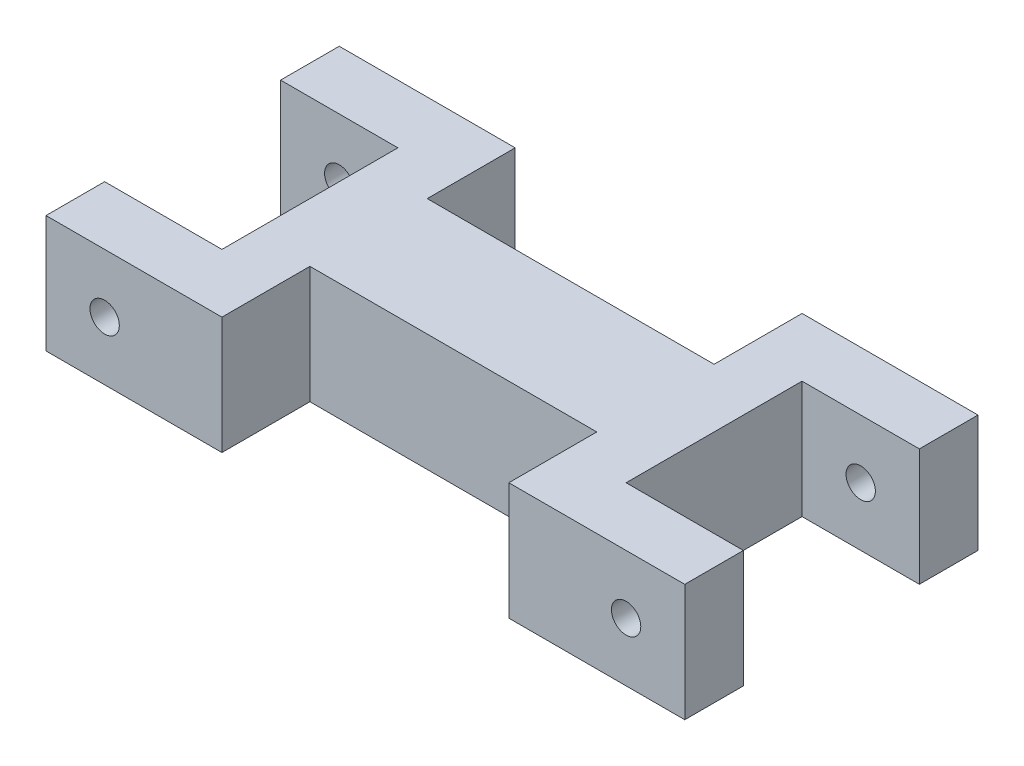
ISO-10303-21;
HEADER;
FILE_DESCRIPTION(('STEP AP214'),'2;1');
FILE_NAME('part.step','',(''),(''),'','','');
FILE_SCHEMA(('AUTOMOTIVE_DESIGN { 1 0 10303 214 1 1 1 1 }'));
ENDSEC;
DATA;
#1=APPLICATION_CONTEXT('core data for automotive mechanical design processes');
#2=APPLICATION_PROTOCOL_DEFINITION('international standard','automotive_design',2000,#1);
#3=PRODUCT_CONTEXT('',#1,'mechanical');
#4=PRODUCT('Part','Part','',(#3));
#5=PRODUCT_RELATED_PRODUCT_CATEGORY('part','',(#4));
#6=PRODUCT_DEFINITION_FORMATION('','',#4);
#7=PRODUCT_DEFINITION_CONTEXT('part definition',#1,'design');
#8=PRODUCT_DEFINITION('design','',#6,#7);
#9=PRODUCT_DEFINITION_SHAPE('','',#8);
#10=(LENGTH_UNIT() NAMED_UNIT(*) SI_UNIT(.MILLI.,.METRE.));
#11=(NAMED_UNIT(*) PLANE_ANGLE_UNIT() SI_UNIT($,.RADIAN.));
#12=(NAMED_UNIT(*) SI_UNIT($,.STERADIAN.) SOLID_ANGLE_UNIT());
#13=UNCERTAINTY_MEASURE_WITH_UNIT(LENGTH_MEASURE(1.E-05),#10,'distance_accuracy_value','');
#14=(GEOMETRIC_REPRESENTATION_CONTEXT(3) GLOBAL_UNCERTAINTY_ASSIGNED_CONTEXT((#13)) GLOBAL_UNIT_ASSIGNED_CONTEXT((#10,
#11,#12)) REPRESENTATION_CONTEXT('',''));
#15=CARTESIAN_POINT('',(0.,0.,0.));
#16=DIRECTION('',(0.,0.,1.));
#17=DIRECTION('',(1.,0.,0.));
#18=AXIS2_PLACEMENT_3D('',#15,#16,#17);
#19=CARTESIAN_POINT('',(0.,12.7,-9.525));
#20=DIRECTION('',(1.,0.,0.));
#21=DIRECTION('',(0.,0.,-1.));
#22=AXIS2_PLACEMENT_3D('',#19,#20,#21);
#23=PLANE('',#22);
#24=DIRECTION('',(0.,0.,1.));
#25=VECTOR('',#24,1.);
#26=CARTESIAN_POINT('',(0.,0.,-9.525));
#27=LINE('',#26,#25);
#28=CARTESIAN_POINT('',(0.,0.,-9.525));
#29=VERTEX_POINT('',#28);
#30=CARTESIAN_POINT('',(0.,0.,9.525));
#31=VERTEX_POINT('',#30);
#32=EDGE_CURVE('E202',#29,#31,#27,.T.);
#33=ORIENTED_EDGE('',*,*,#32,.T.);
#34=DIRECTION('',(0.,-1.,0.));
#35=VECTOR('',#34,1.);
#36=CARTESIAN_POINT('',(0.,12.7,9.525));
#37=LINE('',#36,#35);
#38=CARTESIAN_POINT('',(0.,12.7,9.525));
#39=VERTEX_POINT('',#38);
#40=EDGE_CURVE('E11',#39,#31,#37,.T.);
#41=ORIENTED_EDGE('',*,*,#40,.F.);
#42=DIRECTION('',(0.,0.,1.));
#43=VECTOR('',#42,1.);
#44=CARTESIAN_POINT('',(0.,12.7,-9.525));
#45=LINE('',#44,#43);
#46=CARTESIAN_POINT('',(0.,12.7,-9.525));
#47=VERTEX_POINT('',#46);
#48=EDGE_CURVE('E241',#47,#39,#45,.T.);
#49=ORIENTED_EDGE('',*,*,#48,.F.);
#50=DIRECTION('',(0.,-1.,0.));
#51=VECTOR('',#50,1.);
#52=CARTESIAN_POINT('',(0.,12.7,-9.525));
#53=LINE('',#52,#51);
#54=EDGE_CURVE('E198',#47,#29,#53,.T.);
#55=ORIENTED_EDGE('',*,*,#54,.T.);
#56=EDGE_LOOP('',(#33,#41,#49,#55));
#57=FACE_BOUND('',#56,.T.);
#58=ADVANCED_FACE('F33',(#57),#23,.F.);
#59=CARTESIAN_POINT('',(0.,12.7,9.525));
#60=DIRECTION('',(0.,0.,1.));
#61=DIRECTION('',(1.,0.,0.));
#62=AXIS2_PLACEMENT_3D('',#59,#60,#61);
#63=PLANE('',#62);
#64=CARTESIAN_POINT('',(-6.35,6.34999999999879,9.525));
#65=DIRECTION('',(0.,0.,1.));
#66=DIRECTION('',(1.,0.,0.));
#67=AXIS2_PLACEMENT_3D('',#64,#65,#66);
#68=CIRCLE('',#67,1.5875);
#69=CARTESIAN_POINT('',(-4.7625,6.34999999999879,9.525));
#70=VERTEX_POINT('',#69);
#71=EDGE_CURVE('E440',#70,#70,#68,.T.);
#72=ORIENTED_EDGE('',*,*,#71,.T.);
#73=EDGE_LOOP('',(#72));
#74=FACE_BOUND('',#73,.T.);
#75=DIRECTION('',(-1.,0.,0.));
#76=VECTOR('',#75,1.);
#77=CARTESIAN_POINT('',(0.,0.,9.525));
#78=LINE('',#77,#76);
#79=CARTESIAN_POINT('',(-12.7,0.,9.525));
#80=VERTEX_POINT('',#79);
#81=EDGE_CURVE('E205',#31,#80,#78,.T.);
#82=ORIENTED_EDGE('',*,*,#81,.T.);
#83=DIRECTION('',(0.,-1.,0.));
#84=VECTOR('',#83,1.);
#85=CARTESIAN_POINT('',(-12.7,12.7,9.525));
#86=LINE('',#85,#84);
#87=CARTESIAN_POINT('',(-12.7,12.7,9.525));
#88=VERTEX_POINT('',#87);
#89=EDGE_CURVE('E42',#88,#80,#86,.T.);
#90=ORIENTED_EDGE('',*,*,#89,.F.);
#91=DIRECTION('',(-1.,0.,0.));
#92=VECTOR('',#91,1.);
#93=CARTESIAN_POINT('',(0.,12.7,9.525));
#94=LINE('',#93,#92);
#95=EDGE_CURVE('E129',#39,#88,#94,.T.);
#96=ORIENTED_EDGE('',*,*,#95,.F.);
#97=ORIENTED_EDGE('',*,*,#40,.T.);
#98=EDGE_LOOP('',(#82,#90,#96,#97));
#99=FACE_BOUND('',#98,.T.);
#100=ADVANCED_FACE('F362',(#74,#99),#63,.F.);
#101=CARTESIAN_POINT('',(-12.7,12.7,9.525));
#102=DIRECTION('',(1.,0.,0.));
#103=DIRECTION('',(0.,0.,-1.));
#104=AXIS2_PLACEMENT_3D('',#101,#102,#103);
#105=PLANE('',#104);
#106=DIRECTION('',(0.,0.,1.));
#107=VECTOR('',#106,1.);
#108=CARTESIAN_POINT('',(-12.7,0.,9.525));
#109=LINE('',#108,#107);
#110=CARTESIAN_POINT('',(-12.7,0.,15.875));
#111=VERTEX_POINT('',#110);
#112=EDGE_CURVE('E208',#80,#111,#109,.T.);
#113=ORIENTED_EDGE('',*,*,#112,.T.);
#114=DIRECTION('',(0.,-1.,0.));
#115=VECTOR('',#114,1.);
#116=CARTESIAN_POINT('',(-12.7,12.7,15.875));
#117=LINE('',#116,#115);
#118=CARTESIAN_POINT('',(-12.7,12.7,15.875));
#119=VERTEX_POINT('',#118);
#120=EDGE_CURVE('E284',#119,#111,#117,.T.);
#121=ORIENTED_EDGE('',*,*,#120,.F.);
#122=DIRECTION('',(0.,0.,1.));
#123=VECTOR('',#122,1.);
#124=CARTESIAN_POINT('',(-12.7,12.7,9.525));
#125=LINE('',#124,#123);
#126=EDGE_CURVE('E293',#88,#119,#125,.T.);
#127=ORIENTED_EDGE('',*,*,#126,.F.);
#128=ORIENTED_EDGE('',*,*,#89,.T.);
#129=EDGE_LOOP('',(#113,#121,#127,#128));
#130=FACE_BOUND('',#129,.T.);
#131=ADVANCED_FACE('F291',(#130),#105,.F.);
#132=CARTESIAN_POINT('',(-12.7,12.7,15.875));
#133=DIRECTION('',(0.,0.,-1.));
#134=DIRECTION('',(-1.,0.,0.));
#135=AXIS2_PLACEMENT_3D('',#132,#133,#134);
#136=PLANE('',#135);
#137=CARTESIAN_POINT('',(-6.35,6.34999999999879,15.875));
#138=DIRECTION('',(0.,0.,1.));
#139=DIRECTION('',(1.,0.,0.));
#140=AXIS2_PLACEMENT_3D('',#137,#138,#139);
#141=CIRCLE('',#140,1.5875);
#142=CARTESIAN_POINT('',(-4.7625,6.34999999999879,15.875));
#143=VERTEX_POINT('',#142);
#144=EDGE_CURVE('E431',#143,#143,#141,.T.);
#145=ORIENTED_EDGE('',*,*,#144,.F.);
#146=EDGE_LOOP('',(#145));
#147=FACE_BOUND('',#146,.T.);
#148=DIRECTION('',(1.,0.,0.));
#149=VECTOR('',#148,1.);
#150=CARTESIAN_POINT('',(-12.7,0.,15.875));
#151=LINE('',#150,#149);
#152=CARTESIAN_POINT('',(6.35,0.,15.875));
#153=VERTEX_POINT('',#152);
#154=EDGE_CURVE('E210',#111,#153,#151,.T.);
#155=ORIENTED_EDGE('',*,*,#154,.T.);
#156=DIRECTION('',(0.,-1.,0.));
#157=VECTOR('',#156,1.);
#158=CARTESIAN_POINT('',(6.35,12.7,15.875));
#159=LINE('',#158,#157);
#160=CARTESIAN_POINT('',(6.35,12.7,15.875));
#161=VERTEX_POINT('',#160);
#162=EDGE_CURVE('E281',#161,#153,#159,.T.);
#163=ORIENTED_EDGE('',*,*,#162,.F.);
#164=DIRECTION('',(1.,0.,0.));
#165=VECTOR('',#164,1.);
#166=CARTESIAN_POINT('',(-12.7,12.7,15.875));
#167=LINE('',#166,#165);
#168=EDGE_CURVE('E311',#119,#161,#167,.T.);
#169=ORIENTED_EDGE('',*,*,#168,.F.);
#170=ORIENTED_EDGE('',*,*,#120,.T.);
#171=EDGE_LOOP('',(#155,#163,#169,#170));
#172=FACE_BOUND('',#171,.T.);
#173=ADVANCED_FACE('F302',(#147,#172),#136,.F.);
#174=CARTESIAN_POINT('',(6.35,12.7,15.875));
#175=DIRECTION('',(-1.,0.,0.));
#176=DIRECTION('',(0.,0.,1.));
#177=AXIS2_PLACEMENT_3D('',#174,#175,#176);
#178=PLANE('',#177);
#179=DIRECTION('',(0.,0.,-1.));
#180=VECTOR('',#179,1.);
#181=CARTESIAN_POINT('',(6.35,0.,15.875));
#182=LINE('',#181,#180);
#183=CARTESIAN_POINT('',(6.34999999999999,0.,6.35));
#184=VERTEX_POINT('',#183);
#185=EDGE_CURVE('E212',#153,#184,#182,.T.);
#186=ORIENTED_EDGE('',*,*,#185,.T.);
#187=DIRECTION('',(0.,-1.,0.));
#188=VECTOR('',#187,1.);
#189=CARTESIAN_POINT('',(6.34999999999999,12.7,6.35));
#190=LINE('',#189,#188);
#191=CARTESIAN_POINT('',(6.34999999999999,12.7,6.35));
#192=VERTEX_POINT('',#191);
#193=EDGE_CURVE('E278',#192,#184,#190,.T.);
#194=ORIENTED_EDGE('',*,*,#193,.F.);
#195=DIRECTION('',(0.,0.,-1.));
#196=VECTOR('',#195,1.);
#197=CARTESIAN_POINT('',(6.35,12.7,15.875));
#198=LINE('',#197,#196);
#199=EDGE_CURVE('E308',#161,#192,#198,.T.);
#200=ORIENTED_EDGE('',*,*,#199,.F.);
#201=ORIENTED_EDGE('',*,*,#162,.T.);
#202=EDGE_LOOP('',(#186,#194,#200,#201));
#203=FACE_BOUND('',#202,.T.);
#204=ADVANCED_FACE('F306',(#203),#178,.F.);
#205=CARTESIAN_POINT('',(6.34999999999999,12.7,6.35));
#206=DIRECTION('',(0.,0.,-1.));
#207=DIRECTION('',(-1.,0.,0.));
#208=AXIS2_PLACEMENT_3D('',#205,#206,#207);
#209=PLANE('',#208);
#210=DIRECTION('',(1.,0.,0.));
#211=VECTOR('',#210,1.);
#212=CARTESIAN_POINT('',(6.34999999999999,0.,6.35));
#213=LINE('',#212,#211);
#214=CARTESIAN_POINT('',(37.410945752,0.,6.35));
#215=VERTEX_POINT('',#214);
#216=EDGE_CURVE('E214',#184,#215,#213,.T.);
#217=ORIENTED_EDGE('',*,*,#216,.T.);
#218=DIRECTION('',(0.,-1.,0.));
#219=VECTOR('',#218,1.);
#220=CARTESIAN_POINT('',(37.410945752,12.7,6.35));
#221=LINE('',#220,#219);
#222=CARTESIAN_POINT('',(37.410945752,12.7,6.35));
#223=VERTEX_POINT('',#222);
#224=EDGE_CURVE('E275',#223,#215,#221,.T.);
#225=ORIENTED_EDGE('',*,*,#224,.F.);
#226=DIRECTION('',(1.,0.,0.));
#227=VECTOR('',#226,1.);
#228=CARTESIAN_POINT('',(6.34999999999999,12.7,6.35));
#229=LINE('',#228,#227);
#230=EDGE_CURVE('E310',#192,#223,#229,.T.);
#231=ORIENTED_EDGE('',*,*,#230,.F.);
#232=ORIENTED_EDGE('',*,*,#193,.T.);
#233=EDGE_LOOP('',(#217,#225,#231,#232));
#234=FACE_BOUND('',#233,.T.);
#235=ADVANCED_FACE('F378',(#234),#209,.F.);
#236=CARTESIAN_POINT('',(37.410945752,12.7,6.35));
#237=DIRECTION('',(1.,0.,0.));
#238=DIRECTION('',(0.,0.,-1.));
#239=AXIS2_PLACEMENT_3D('',#236,#237,#238);
#240=PLANE('',#239);
#241=DIRECTION('',(0.,0.,1.));
#242=VECTOR('',#241,1.);
#243=CARTESIAN_POINT('',(37.410945752,0.,6.35));
#244=LINE('',#243,#242);
#245=CARTESIAN_POINT('',(37.410945752,0.,15.875));
#246=VERTEX_POINT('',#245);
#247=EDGE_CURVE('E216',#215,#246,#244,.T.);
#248=ORIENTED_EDGE('',*,*,#247,.T.);
#249=DIRECTION('',(0.,-1.,0.));
#250=VECTOR('',#249,1.);
#251=CARTESIAN_POINT('',(37.410945752,12.7,15.875));
#252=LINE('',#251,#250);
#253=CARTESIAN_POINT('',(37.410945752,12.7,15.875));
#254=VERTEX_POINT('',#253);
#255=EDGE_CURVE('E272',#254,#246,#252,.T.);
#256=ORIENTED_EDGE('',*,*,#255,.F.);
#257=DIRECTION('',(0.,0.,1.));
#258=VECTOR('',#257,1.);
#259=CARTESIAN_POINT('',(37.410945752,12.7,6.35));
#260=LINE('',#259,#258);
#261=EDGE_CURVE('E313',#223,#254,#260,.T.);
#262=ORIENTED_EDGE('',*,*,#261,.F.);
#263=ORIENTED_EDGE('',*,*,#224,.T.);
#264=EDGE_LOOP('',(#248,#256,#262,#263));
#265=FACE_BOUND('',#264,.T.);
#266=ADVANCED_FACE('F381',(#265),#240,.F.);
#267=CARTESIAN_POINT('',(37.410945752,12.7,15.875));
#268=DIRECTION('',(0.,0.,-1.));
#269=DIRECTION('',(-1.,0.,0.));
#270=AXIS2_PLACEMENT_3D('',#267,#268,#269);
#271=PLANE('',#270);
#272=CARTESIAN_POINT('',(50.110945752,6.35,15.875));
#273=DIRECTION('',(0.,0.,1.));
#274=DIRECTION('',(1.,0.,0.));
#275=AXIS2_PLACEMENT_3D('',#272,#273,#274);
#276=CIRCLE('',#275,1.58749999999998);
#277=CARTESIAN_POINT('',(51.698445752,6.35,15.875));
#278=VERTEX_POINT('',#277);
#279=EDGE_CURVE('E430',#278,#278,#276,.T.);
#280=ORIENTED_EDGE('',*,*,#279,.F.);
#281=EDGE_LOOP('',(#280));
#282=FACE_BOUND('',#281,.T.);
#283=DIRECTION('',(1.,0.,0.));
#284=VECTOR('',#283,1.);
#285=CARTESIAN_POINT('',(37.410945752,0.,15.875));
#286=LINE('',#285,#284);
#287=CARTESIAN_POINT('',(56.460945752,0.,15.875));
#288=VERTEX_POINT('',#287);
#289=EDGE_CURVE('E218',#246,#288,#286,.T.);
#290=ORIENTED_EDGE('',*,*,#289,.T.);
#291=DIRECTION('',(0.,-1.,0.));
#292=VECTOR('',#291,1.);
#293=CARTESIAN_POINT('',(56.460945752,12.7,15.875));
#294=LINE('',#293,#292);
#295=CARTESIAN_POINT('',(56.460945752,12.7,15.875));
#296=VERTEX_POINT('',#295);
#297=EDGE_CURVE('E269',#296,#288,#294,.T.);
#298=ORIENTED_EDGE('',*,*,#297,.F.);
#299=DIRECTION('',(1.,0.,0.));
#300=VECTOR('',#299,1.);
#301=CARTESIAN_POINT('',(37.410945752,12.7,15.875));
#302=LINE('',#301,#300);
#303=EDGE_CURVE('E319',#254,#296,#302,.T.);
#304=ORIENTED_EDGE('',*,*,#303,.F.);
#305=ORIENTED_EDGE('',*,*,#255,.T.);
#306=EDGE_LOOP('',(#290,#298,#304,#305));
#307=FACE_BOUND('',#306,.T.);
#308=ADVANCED_FACE('F385',(#282,#307),#271,.F.);
#309=CARTESIAN_POINT('',(56.460945752,12.7,15.875));
#310=DIRECTION('',(-1.,0.,0.));
#311=DIRECTION('',(0.,0.,1.));
#312=AXIS2_PLACEMENT_3D('',#309,#310,#311);
#313=PLANE('',#312);
#314=DIRECTION('',(0.,0.,-1.));
#315=VECTOR('',#314,1.);
#316=CARTESIAN_POINT('',(56.460945752,0.,15.875));
#317=LINE('',#316,#315);
#318=CARTESIAN_POINT('',(56.460945752,0.,9.525));
#319=VERTEX_POINT('',#318);
#320=EDGE_CURVE('E220',#288,#319,#317,.T.);
#321=ORIENTED_EDGE('',*,*,#320,.T.);
#322=DIRECTION('',(0.,-1.,0.));
#323=VECTOR('',#322,1.);
#324=CARTESIAN_POINT('',(56.460945752,12.7,9.525));
#325=LINE('',#324,#323);
#326=CARTESIAN_POINT('',(56.460945752,12.7,9.525));
#327=VERTEX_POINT('',#326);
#328=EDGE_CURVE('E266',#327,#319,#325,.T.);
#329=ORIENTED_EDGE('',*,*,#328,.F.);
#330=DIRECTION('',(0.,0.,-1.));
#331=VECTOR('',#330,1.);
#332=CARTESIAN_POINT('',(56.460945752,12.7,15.875));
#333=LINE('',#332,#331);
#334=EDGE_CURVE('E321',#296,#327,#333,.T.);
#335=ORIENTED_EDGE('',*,*,#334,.F.);
#336=ORIENTED_EDGE('',*,*,#297,.T.);
#337=EDGE_LOOP('',(#321,#329,#335,#336));
#338=FACE_BOUND('',#337,.T.);
#339=ADVANCED_FACE('F389',(#338),#313,.F.);
#340=CARTESIAN_POINT('',(56.460945752,12.7,9.525));
#341=DIRECTION('',(0.,0.,1.));
#342=DIRECTION('',(1.,0.,0.));
#343=AXIS2_PLACEMENT_3D('',#340,#341,#342);
#344=PLANE('',#343);
#345=CARTESIAN_POINT('',(50.110945752,6.35,9.525));
#346=DIRECTION('',(0.,0.,1.));
#347=DIRECTION('',(1.,0.,0.));
#348=AXIS2_PLACEMENT_3D('',#345,#346,#347);
#349=CIRCLE('',#348,1.58749999999998);
#350=CARTESIAN_POINT('',(51.698445752,6.35,9.525));
#351=VERTEX_POINT('',#350);
#352=EDGE_CURVE('E206',#351,#351,#349,.T.);
#353=ORIENTED_EDGE('',*,*,#352,.T.);
#354=EDGE_LOOP('',(#353));
#355=FACE_BOUND('',#354,.T.);
#356=DIRECTION('',(-1.,0.,0.));
#357=VECTOR('',#356,1.);
#358=CARTESIAN_POINT('',(56.460945752,0.,9.525));
#359=LINE('',#358,#357);
#360=CARTESIAN_POINT('',(43.760945752,0.,9.525));
#361=VERTEX_POINT('',#360);
#362=EDGE_CURVE('E222',#319,#361,#359,.T.);
#363=ORIENTED_EDGE('',*,*,#362,.T.);
#364=DIRECTION('',(0.,-1.,0.));
#365=VECTOR('',#364,1.);
#366=CARTESIAN_POINT('',(43.760945752,12.7,9.525));
#367=LINE('',#366,#365);
#368=CARTESIAN_POINT('',(43.760945752,12.7,9.525));
#369=VERTEX_POINT('',#368);
#370=EDGE_CURVE('E263',#369,#361,#367,.T.);
#371=ORIENTED_EDGE('',*,*,#370,.F.);
#372=DIRECTION('',(-1.,0.,0.));
#373=VECTOR('',#372,1.);
#374=CARTESIAN_POINT('',(56.460945752,12.7,9.525));
#375=LINE('',#374,#373);
#376=EDGE_CURVE('E323',#327,#369,#375,.T.);
#377=ORIENTED_EDGE('',*,*,#376,.F.);
#378=ORIENTED_EDGE('',*,*,#328,.T.);
#379=EDGE_LOOP('',(#363,#371,#377,#378));
#380=FACE_BOUND('',#379,.T.);
#381=ADVANCED_FACE('F393',(#355,#380),#344,.F.);
#382=CARTESIAN_POINT('',(43.760945752,12.7,-9.525));
#383=DIRECTION('',(-1.,0.,0.));
#384=DIRECTION('',(0.,0.,1.));
#385=AXIS2_PLACEMENT_3D('',#382,#383,#384);
#386=PLANE('',#385);
#387=DIRECTION('',(0.,0.,-1.));
#388=VECTOR('',#387,1.);
#389=CARTESIAN_POINT('',(43.760945752,0.,-9.525));
#390=LINE('',#389,#388);
#391=CARTESIAN_POINT('',(43.760945752,0.,-9.525));
#392=VERTEX_POINT('',#391);
#393=EDGE_CURVE('E224',#361,#392,#390,.T.);
#394=ORIENTED_EDGE('',*,*,#393,.T.);
#395=DIRECTION('',(0.,-1.,0.));
#396=VECTOR('',#395,1.);
#397=CARTESIAN_POINT('',(43.760945752,12.7,-9.525));
#398=LINE('',#397,#396);
#399=CARTESIAN_POINT('',(43.760945752,12.7,-9.525));
#400=VERTEX_POINT('',#399);
#401=EDGE_CURVE('E260',#400,#392,#398,.T.);
#402=ORIENTED_EDGE('',*,*,#401,.F.);
#403=DIRECTION('',(0.,0.,-1.));
#404=VECTOR('',#403,1.);
#405=CARTESIAN_POINT('',(43.760945752,12.7,-9.525));
#406=LINE('',#405,#404);
#407=EDGE_CURVE('E325',#369,#400,#406,.T.);
#408=ORIENTED_EDGE('',*,*,#407,.F.);
#409=ORIENTED_EDGE('',*,*,#370,.T.);
#410=EDGE_LOOP('',(#394,#402,#408,#409));
#411=FACE_BOUND('',#410,.T.);
#412=ADVANCED_FACE('F397',(#411),#386,.F.);
#413=CARTESIAN_POINT('',(56.460945752,12.7,-9.525));
#414=DIRECTION('',(0.,0.,-1.));
#415=DIRECTION('',(-1.,0.,0.));
#416=AXIS2_PLACEMENT_3D('',#413,#414,#415);
#417=PLANE('',#416);
#418=CARTESIAN_POINT('',(50.110945752,6.35,-9.525));
#419=DIRECTION('',(0.,0.,-1.));
#420=DIRECTION('',(-1.,0.,0.));
#421=AXIS2_PLACEMENT_3D('',#418,#419,#420);
#422=CIRCLE('',#421,1.58749999999998);
#423=CARTESIAN_POINT('',(48.523445752,6.35,-9.525));
#424=VERTEX_POINT('',#423);
#425=EDGE_CURVE('E442',#424,#424,#422,.T.);
#426=ORIENTED_EDGE('',*,*,#425,.T.);
#427=EDGE_LOOP('',(#426));
#428=FACE_BOUND('',#427,.T.);
#429=DIRECTION('',(1.,0.,0.));
#430=VECTOR('',#429,1.);
#431=CARTESIAN_POINT('',(56.460945752,0.,-9.525));
#432=LINE('',#431,#430);
#433=CARTESIAN_POINT('',(56.460945752,0.,-9.525));
#434=VERTEX_POINT('',#433);
#435=EDGE_CURVE('E226',#392,#434,#432,.T.);
#436=ORIENTED_EDGE('',*,*,#435,.T.);
#437=DIRECTION('',(0.,-1.,0.));
#438=VECTOR('',#437,1.);
#439=CARTESIAN_POINT('',(56.460945752,12.7,-9.525));
#440=LINE('',#439,#438);
#441=CARTESIAN_POINT('',(56.460945752,12.7,-9.525));
#442=VERTEX_POINT('',#441);
#443=EDGE_CURVE('E257',#442,#434,#440,.T.);
#444=ORIENTED_EDGE('',*,*,#443,.F.);
#445=DIRECTION('',(1.,0.,0.));
#446=VECTOR('',#445,1.);
#447=CARTESIAN_POINT('',(56.460945752,12.7,-9.525));
#448=LINE('',#447,#446);
#449=EDGE_CURVE('E327',#400,#442,#448,.T.);
#450=ORIENTED_EDGE('',*,*,#449,.F.);
#451=ORIENTED_EDGE('',*,*,#401,.T.);
#452=EDGE_LOOP('',(#436,#444,#450,#451));
#453=FACE_BOUND('',#452,.T.);
#454=ADVANCED_FACE('F401',(#428,#453),#417,.F.);
#455=CARTESIAN_POINT('',(56.460945752,12.7,-15.875));
#456=DIRECTION('',(-1.,0.,0.));
#457=DIRECTION('',(0.,0.,1.));
#458=AXIS2_PLACEMENT_3D('',#455,#456,#457);
#459=PLANE('',#458);
#460=DIRECTION('',(0.,0.,-1.));
#461=VECTOR('',#460,1.);
#462=CARTESIAN_POINT('',(56.460945752,0.,-15.875));
#463=LINE('',#462,#461);
#464=CARTESIAN_POINT('',(56.460945752,0.,-15.875));
#465=VERTEX_POINT('',#464);
#466=EDGE_CURVE('E228',#434,#465,#463,.T.);
#467=ORIENTED_EDGE('',*,*,#466,.T.);
#468=DIRECTION('',(0.,-1.,0.));
#469=VECTOR('',#468,1.);
#470=CARTESIAN_POINT('',(56.460945752,12.7,-15.875));
#471=LINE('',#470,#469);
#472=CARTESIAN_POINT('',(56.460945752,12.7,-15.875));
#473=VERTEX_POINT('',#472);
#474=EDGE_CURVE('E254',#473,#465,#471,.T.);
#475=ORIENTED_EDGE('',*,*,#474,.F.);
#476=DIRECTION('',(0.,0.,-1.));
#477=VECTOR('',#476,1.);
#478=CARTESIAN_POINT('',(56.460945752,12.7,-15.875));
#479=LINE('',#478,#477);
#480=EDGE_CURVE('E329',#442,#473,#479,.T.);
#481=ORIENTED_EDGE('',*,*,#480,.F.);
#482=ORIENTED_EDGE('',*,*,#443,.T.);
#483=EDGE_LOOP('',(#467,#475,#481,#482));
#484=FACE_BOUND('',#483,.T.);
#485=ADVANCED_FACE('F405',(#484),#459,.F.);
#486=CARTESIAN_POINT('',(37.410945752,12.7,-15.875));
#487=DIRECTION('',(0.,0.,1.));
#488=DIRECTION('',(1.,0.,0.));
#489=AXIS2_PLACEMENT_3D('',#486,#487,#488);
#490=PLANE('',#489);
#491=CARTESIAN_POINT('',(50.110945752,6.35,-15.875));
#492=DIRECTION('',(0.,0.,1.));
#493=DIRECTION('',(1.,0.,0.));
#494=AXIS2_PLACEMENT_3D('',#491,#492,#493);
#495=CIRCLE('',#494,1.58749999999998);
#496=CARTESIAN_POINT('',(51.698445752,6.35,-15.875));
#497=VERTEX_POINT('',#496);
#498=EDGE_CURVE('E434',#497,#497,#495,.T.);
#499=ORIENTED_EDGE('',*,*,#498,.T.);
#500=EDGE_LOOP('',(#499));
#501=FACE_BOUND('',#500,.T.);
#502=DIRECTION('',(-1.,0.,0.));
#503=VECTOR('',#502,1.);
#504=CARTESIAN_POINT('',(37.410945752,0.,-15.875));
#505=LINE('',#504,#503);
#506=CARTESIAN_POINT('',(37.410945752,0.,-15.875));
#507=VERTEX_POINT('',#506);
#508=EDGE_CURVE('E230',#465,#507,#505,.T.);
#509=ORIENTED_EDGE('',*,*,#508,.T.);
#510=DIRECTION('',(0.,-1.,0.));
#511=VECTOR('',#510,1.);
#512=CARTESIAN_POINT('',(37.410945752,12.7,-15.875));
#513=LINE('',#512,#511);
#514=CARTESIAN_POINT('',(37.410945752,12.7,-15.875));
#515=VERTEX_POINT('',#514);
#516=EDGE_CURVE('E251',#515,#507,#513,.T.);
#517=ORIENTED_EDGE('',*,*,#516,.F.);
#518=DIRECTION('',(-1.,0.,0.));
#519=VECTOR('',#518,1.);
#520=CARTESIAN_POINT('',(37.410945752,12.7,-15.875));
#521=LINE('',#520,#519);
#522=EDGE_CURVE('E331',#473,#515,#521,.T.);
#523=ORIENTED_EDGE('',*,*,#522,.F.);
#524=ORIENTED_EDGE('',*,*,#474,.T.);
#525=EDGE_LOOP('',(#509,#517,#523,#524));
#526=FACE_BOUND('',#525,.T.);
#527=ADVANCED_FACE('F409',(#501,#526),#490,.F.);
#528=CARTESIAN_POINT('',(37.410945752,12.7,-6.35));
#529=DIRECTION('',(1.,0.,0.));
#530=DIRECTION('',(0.,0.,-1.));
#531=AXIS2_PLACEMENT_3D('',#528,#529,#530);
#532=PLANE('',#531);
#533=DIRECTION('',(0.,0.,1.));
#534=VECTOR('',#533,1.);
#535=CARTESIAN_POINT('',(37.410945752,0.,-6.35));
#536=LINE('',#535,#534);
#537=CARTESIAN_POINT('',(37.410945752,0.,-6.35));
#538=VERTEX_POINT('',#537);
#539=EDGE_CURVE('E232',#507,#538,#536,.T.);
#540=ORIENTED_EDGE('',*,*,#539,.T.);
#541=DIRECTION('',(0.,-1.,0.));
#542=VECTOR('',#541,1.);
#543=CARTESIAN_POINT('',(37.410945752,12.7,-6.35));
#544=LINE('',#543,#542);
#545=CARTESIAN_POINT('',(37.410945752,12.7,-6.35));
#546=VERTEX_POINT('',#545);
#547=EDGE_CURVE('E248',#546,#538,#544,.T.);
#548=ORIENTED_EDGE('',*,*,#547,.F.);
#549=DIRECTION('',(0.,0.,1.));
#550=VECTOR('',#549,1.);
#551=CARTESIAN_POINT('',(37.410945752,12.7,-6.35));
#552=LINE('',#551,#550);
#553=EDGE_CURVE('E333',#515,#546,#552,.T.);
#554=ORIENTED_EDGE('',*,*,#553,.F.);
#555=ORIENTED_EDGE('',*,*,#516,.T.);
#556=EDGE_LOOP('',(#540,#548,#554,#555));
#557=FACE_BOUND('',#556,.T.);
#558=ADVANCED_FACE('F413',(#557),#532,.F.);
#559=CARTESIAN_POINT('',(6.34999999999999,12.7,-6.35));
#560=DIRECTION('',(0.,0.,1.));
#561=DIRECTION('',(1.,0.,0.));
#562=AXIS2_PLACEMENT_3D('',#559,#560,#561);
#563=PLANE('',#562);
#564=DIRECTION('',(-1.,0.,0.));
#565=VECTOR('',#564,1.);
#566=CARTESIAN_POINT('',(6.34999999999999,0.,-6.35));
#567=LINE('',#566,#565);
#568=CARTESIAN_POINT('',(6.34999999999999,0.,-6.35));
#569=VERTEX_POINT('',#568);
#570=EDGE_CURVE('E234',#538,#569,#567,.T.);
#571=ORIENTED_EDGE('',*,*,#570,.T.);
#572=DIRECTION('',(0.,-1.,0.));
#573=VECTOR('',#572,1.);
#574=CARTESIAN_POINT('',(6.34999999999999,12.7,-6.35));
#575=LINE('',#574,#573);
#576=CARTESIAN_POINT('',(6.34999999999999,12.7,-6.35));
#577=VERTEX_POINT('',#576);
#578=EDGE_CURVE('E245',#577,#569,#575,.T.);
#579=ORIENTED_EDGE('',*,*,#578,.F.);
#580=DIRECTION('',(-1.,0.,0.));
#581=VECTOR('',#580,1.);
#582=CARTESIAN_POINT('',(6.34999999999999,12.7,-6.35));
#583=LINE('',#582,#581);
#584=EDGE_CURVE('E335',#546,#577,#583,.T.);
#585=ORIENTED_EDGE('',*,*,#584,.F.);
#586=ORIENTED_EDGE('',*,*,#547,.T.);
#587=EDGE_LOOP('',(#571,#579,#585,#586));
#588=FACE_BOUND('',#587,.T.);
#589=ADVANCED_FACE('F341',(#588),#563,.F.);
#590=CARTESIAN_POINT('',(6.35,12.7,-15.875));
#591=DIRECTION('',(-1.,0.,0.));
#592=DIRECTION('',(0.,0.,1.));
#593=AXIS2_PLACEMENT_3D('',#590,#591,#592);
#594=PLANE('',#593);
#595=DIRECTION('',(0.,0.,-1.));
#596=VECTOR('',#595,1.);
#597=CARTESIAN_POINT('',(6.35,0.,-15.875));
#598=LINE('',#597,#596);
#599=CARTESIAN_POINT('',(6.35,0.,-15.875));
#600=VERTEX_POINT('',#599);
#601=EDGE_CURVE('E236',#569,#600,#598,.T.);
#602=ORIENTED_EDGE('',*,*,#601,.T.);
#603=DIRECTION('',(0.,-1.,0.));
#604=VECTOR('',#603,1.);
#605=CARTESIAN_POINT('',(6.35,12.7,-15.875));
#606=LINE('',#605,#604);
#607=CARTESIAN_POINT('',(6.35,12.7,-15.875));
#608=VERTEX_POINT('',#607);
#609=EDGE_CURVE('E193',#608,#600,#606,.T.);
#610=ORIENTED_EDGE('',*,*,#609,.F.);
#611=DIRECTION('',(0.,0.,-1.));
#612=VECTOR('',#611,1.);
#613=CARTESIAN_POINT('',(6.35,12.7,-15.875));
#614=LINE('',#613,#612);
#615=EDGE_CURVE('E184',#577,#608,#614,.T.);
#616=ORIENTED_EDGE('',*,*,#615,.F.);
#617=ORIENTED_EDGE('',*,*,#578,.T.);
#618=EDGE_LOOP('',(#602,#610,#616,#617));
#619=FACE_BOUND('',#618,.T.);
#620=ADVANCED_FACE('F345',(#619),#594,.F.);
#621=CARTESIAN_POINT('',(-12.7,12.7,-15.875));
#622=DIRECTION('',(0.,0.,1.));
#623=DIRECTION('',(1.,0.,0.));
#624=AXIS2_PLACEMENT_3D('',#621,#622,#623);
#625=PLANE('',#624);
#626=CARTESIAN_POINT('',(-6.35,6.34999999999879,-15.875));
#627=DIRECTION('',(0.,0.,1.));
#628=DIRECTION('',(1.,0.,0.));
#629=AXIS2_PLACEMENT_3D('',#626,#627,#628);
#630=CIRCLE('',#629,1.5875);
#631=CARTESIAN_POINT('',(-4.7625,6.34999999999879,-15.875));
#632=VERTEX_POINT('',#631);
#633=EDGE_CURVE('E428',#632,#632,#630,.T.);
#634=ORIENTED_EDGE('',*,*,#633,.T.);
#635=EDGE_LOOP('',(#634));
#636=FACE_BOUND('',#635,.T.);
#637=DIRECTION('',(-1.,0.,0.));
#638=VECTOR('',#637,1.);
#639=CARTESIAN_POINT('',(-12.7,0.,-15.875));
#640=LINE('',#639,#638);
#641=CARTESIAN_POINT('',(-12.7,0.,-15.875));
#642=VERTEX_POINT('',#641);
#643=EDGE_CURVE('E192',#600,#642,#640,.T.);
#644=ORIENTED_EDGE('',*,*,#643,.T.);
#645=DIRECTION('',(0.,-1.,0.));
#646=VECTOR('',#645,1.);
#647=CARTESIAN_POINT('',(-12.7,12.7,-15.875));
#648=LINE('',#647,#646);
#649=CARTESIAN_POINT('',(-12.7,12.7,-15.875));
#650=VERTEX_POINT('',#649);
#651=EDGE_CURVE('E189',#650,#642,#648,.T.);
#652=ORIENTED_EDGE('',*,*,#651,.F.);
#653=DIRECTION('',(-1.,0.,0.));
#654=VECTOR('',#653,1.);
#655=CARTESIAN_POINT('',(-12.7,12.7,-15.875));
#656=LINE('',#655,#654);
#657=EDGE_CURVE('E178',#608,#650,#656,.T.);
#658=ORIENTED_EDGE('',*,*,#657,.F.);
#659=ORIENTED_EDGE('',*,*,#609,.T.);
#660=EDGE_LOOP('',(#644,#652,#658,#659));
#661=FACE_BOUND('',#660,.T.);
#662=ADVANCED_FACE('F190',(#636,#661),#625,.F.);
#663=CARTESIAN_POINT('',(-12.7,12.7,-9.525));
#664=DIRECTION('',(1.,0.,0.));
#665=DIRECTION('',(0.,0.,-1.));
#666=AXIS2_PLACEMENT_3D('',#663,#664,#665);
#667=PLANE('',#666);
#668=DIRECTION('',(0.,0.,1.));
#669=VECTOR('',#668,1.);
#670=CARTESIAN_POINT('',(-12.7,0.,-9.525));
#671=LINE('',#670,#669);
#672=CARTESIAN_POINT('',(-12.7,0.,-9.525));
#673=VERTEX_POINT('',#672);
#674=EDGE_CURVE('E115',#642,#673,#671,.T.);
#675=ORIENTED_EDGE('',*,*,#674,.T.);
#676=DIRECTION('',(0.,-1.,0.));
#677=VECTOR('',#676,1.);
#678=CARTESIAN_POINT('',(-12.7,12.7,-9.525));
#679=LINE('',#678,#677);
#680=CARTESIAN_POINT('',(-12.7,12.7,-9.525));
#681=VERTEX_POINT('',#680);
#682=EDGE_CURVE('E194',#681,#673,#679,.T.);
#683=ORIENTED_EDGE('',*,*,#682,.F.);
#684=DIRECTION('',(0.,0.,1.));
#685=VECTOR('',#684,1.);
#686=CARTESIAN_POINT('',(-12.7,12.7,-9.525));
#687=LINE('',#686,#685);
#688=EDGE_CURVE('E182',#650,#681,#687,.T.);
#689=ORIENTED_EDGE('',*,*,#688,.F.);
#690=ORIENTED_EDGE('',*,*,#651,.T.);
#691=EDGE_LOOP('',(#675,#683,#689,#690));
#692=FACE_BOUND('',#691,.T.);
#693=ADVANCED_FACE('F196',(#692),#667,.F.);
#694=CARTESIAN_POINT('',(0.,12.7,-9.525));
#695=DIRECTION('',(0.,0.,-1.));
#696=DIRECTION('',(-1.,0.,0.));
#697=AXIS2_PLACEMENT_3D('',#694,#695,#696);
#698=PLANE('',#697);
#699=CARTESIAN_POINT('',(-6.35,6.34999999999879,-9.525));
#700=DIRECTION('',(0.,0.,-1.));
#701=DIRECTION('',(-1.,0.,0.));
#702=AXIS2_PLACEMENT_3D('',#699,#700,#701);
#703=CIRCLE('',#702,1.5875);
#704=CARTESIAN_POINT('',(-7.9375,6.34999999999879,-9.525));
#705=VERTEX_POINT('',#704);
#706=EDGE_CURVE('E36',#705,#705,#703,.T.);
#707=ORIENTED_EDGE('',*,*,#706,.T.);
#708=EDGE_LOOP('',(#707));
#709=FACE_BOUND('',#708,.T.);
#710=DIRECTION('',(1.,0.,0.));
#711=VECTOR('',#710,1.);
#712=CARTESIAN_POINT('',(0.,0.,-9.525));
#713=LINE('',#712,#711);
#714=EDGE_CURVE('E121',#673,#29,#713,.T.);
#715=ORIENTED_EDGE('',*,*,#714,.T.);
#716=ORIENTED_EDGE('',*,*,#54,.F.);
#717=DIRECTION('',(1.,0.,0.));
#718=VECTOR('',#717,1.);
#719=CARTESIAN_POINT('',(0.,12.7,-9.525));
#720=LINE('',#719,#718);
#721=EDGE_CURVE('E50',#681,#47,#720,.T.);
#722=ORIENTED_EDGE('',*,*,#721,.F.);
#723=ORIENTED_EDGE('',*,*,#682,.T.);
#724=EDGE_LOOP('',(#715,#716,#722,#723));
#725=FACE_BOUND('',#724,.T.);
#726=ADVANCED_FACE('F349',(#709,#725),#698,.F.);
#727=CARTESIAN_POINT('',(0.,12.7,0.));
#728=DIRECTION('',(0.,-1.,0.));
#729=DIRECTION('',(0.,0.,-1.));
#730=AXIS2_PLACEMENT_3D('',#727,#728,#729);
#731=PLANE('',#730);
#732=ORIENTED_EDGE('',*,*,#48,.T.);
#733=ORIENTED_EDGE('',*,*,#95,.T.);
#734=ORIENTED_EDGE('',*,*,#126,.T.);
#735=ORIENTED_EDGE('',*,*,#168,.T.);
#736=ORIENTED_EDGE('',*,*,#199,.T.);
#737=ORIENTED_EDGE('',*,*,#230,.T.);
#738=ORIENTED_EDGE('',*,*,#261,.T.);
#739=ORIENTED_EDGE('',*,*,#303,.T.);
#740=ORIENTED_EDGE('',*,*,#334,.T.);
#741=ORIENTED_EDGE('',*,*,#376,.T.);
#742=ORIENTED_EDGE('',*,*,#407,.T.);
#743=ORIENTED_EDGE('',*,*,#449,.T.);
#744=ORIENTED_EDGE('',*,*,#480,.T.);
#745=ORIENTED_EDGE('',*,*,#522,.T.);
#746=ORIENTED_EDGE('',*,*,#553,.T.);
#747=ORIENTED_EDGE('',*,*,#584,.T.);
#748=ORIENTED_EDGE('',*,*,#615,.T.);
#749=ORIENTED_EDGE('',*,*,#657,.T.);
#750=ORIENTED_EDGE('',*,*,#688,.T.);
#751=ORIENTED_EDGE('',*,*,#721,.T.);
#752=EDGE_LOOP('',(#732,#733,#734,#735,#736,#737,#738,#739,#740,#741,#742,#743,#744,#745,#746,
#747,#748,#749,#750,#751));
#753=FACE_BOUND('',#752,.T.);
#754=ADVANCED_FACE('F180',(#753),#731,.F.);
#755=CARTESIAN_POINT('',(0.,0.,0.));
#756=DIRECTION('',(0.,-1.,0.));
#757=DIRECTION('',(0.,0.,-1.));
#758=AXIS2_PLACEMENT_3D('',#755,#756,#757);
#759=PLANE('',#758);
#760=ORIENTED_EDGE('',*,*,#32,.F.);
#761=ORIENTED_EDGE('',*,*,#714,.F.);
#762=ORIENTED_EDGE('',*,*,#674,.F.);
#763=ORIENTED_EDGE('',*,*,#643,.F.);
#764=ORIENTED_EDGE('',*,*,#601,.F.);
#765=ORIENTED_EDGE('',*,*,#570,.F.);
#766=ORIENTED_EDGE('',*,*,#539,.F.);
#767=ORIENTED_EDGE('',*,*,#508,.F.);
#768=ORIENTED_EDGE('',*,*,#466,.F.);
#769=ORIENTED_EDGE('',*,*,#435,.F.);
#770=ORIENTED_EDGE('',*,*,#393,.F.);
#771=ORIENTED_EDGE('',*,*,#362,.F.);
#772=ORIENTED_EDGE('',*,*,#320,.F.);
#773=ORIENTED_EDGE('',*,*,#289,.F.);
#774=ORIENTED_EDGE('',*,*,#247,.F.);
#775=ORIENTED_EDGE('',*,*,#216,.F.);
#776=ORIENTED_EDGE('',*,*,#185,.F.);
#777=ORIENTED_EDGE('',*,*,#154,.F.);
#778=ORIENTED_EDGE('',*,*,#112,.F.);
#779=ORIENTED_EDGE('',*,*,#81,.F.);
#780=EDGE_LOOP('',(#760,#761,#762,#763,#764,#765,#766,#767,#768,#769,#770,#771,#772,#773,#774,
#775,#776,#777,#778,#779));
#781=FACE_BOUND('',#780,.T.);
#782=ADVANCED_FACE('F297',(#781),#759,.T.);
#783=CARTESIAN_POINT('',(-6.35,6.34999999999879,-15.875));
#784=DIRECTION('',(0.,0.,1.));
#785=DIRECTION('',(1.,0.,0.));
#786=AXIS2_PLACEMENT_3D('',#783,#784,#785);
#787=CYLINDRICAL_SURFACE('',#786,1.5875);
#788=ORIENTED_EDGE('',*,*,#633,.F.);
#789=EDGE_LOOP('',(#788));
#790=FACE_BOUND('',#789,.T.);
#791=ORIENTED_EDGE('',*,*,#706,.F.);
#792=EDGE_LOOP('',(#791));
#793=FACE_BOUND('',#792,.T.);
#794=ADVANCED_FACE('F463',(#790,#793),#787,.F.);
#795=CARTESIAN_POINT('',(50.110945752,6.35,-15.875));
#796=DIRECTION('',(0.,0.,1.));
#797=DIRECTION('',(1.,0.,0.));
#798=AXIS2_PLACEMENT_3D('',#795,#796,#797);
#799=CYLINDRICAL_SURFACE('',#798,1.58749999999998);
#800=ORIENTED_EDGE('',*,*,#498,.F.);
#801=EDGE_LOOP('',(#800));
#802=FACE_BOUND('',#801,.T.);
#803=ORIENTED_EDGE('',*,*,#425,.F.);
#804=EDGE_LOOP('',(#803));
#805=FACE_BOUND('',#804,.T.);
#806=ADVANCED_FACE('F454',(#802,#805),#799,.F.);
#807=ORIENTED_EDGE('',*,*,#279,.T.);
#808=EDGE_LOOP('',(#807));
#809=FACE_BOUND('',#808,.T.);
#810=ORIENTED_EDGE('',*,*,#352,.F.);
#811=EDGE_LOOP('',(#810));
#812=FACE_BOUND('',#811,.T.);
#813=ADVANCED_FACE('F451',(#809,#812),#799,.F.);
#814=ORIENTED_EDGE('',*,*,#144,.T.);
#815=EDGE_LOOP('',(#814));
#816=FACE_BOUND('',#815,.T.);
#817=ORIENTED_EDGE('',*,*,#71,.F.);
#818=EDGE_LOOP('',(#817));
#819=FACE_BOUND('',#818,.T.);
#820=ADVANCED_FACE('F453',(#816,#819),#787,.F.);
#821=CLOSED_SHELL('',(#58,#100,#131,#173,#204,#235,#266,#308,#339,#381,#412,#454,#485,#527,#558,
#589,#620,#662,#693,#726,#754,#782,#794,#806,#813,#820));
#822=MANIFOLD_SOLID_BREP('B2',#821);
#823=ADVANCED_BREP_SHAPE_REPRESENTATION('',(#18,#822),#14);
#824=SHAPE_DEFINITION_REPRESENTATION(#9,#823);
ENDSEC;
END-ISO-10303-21;
